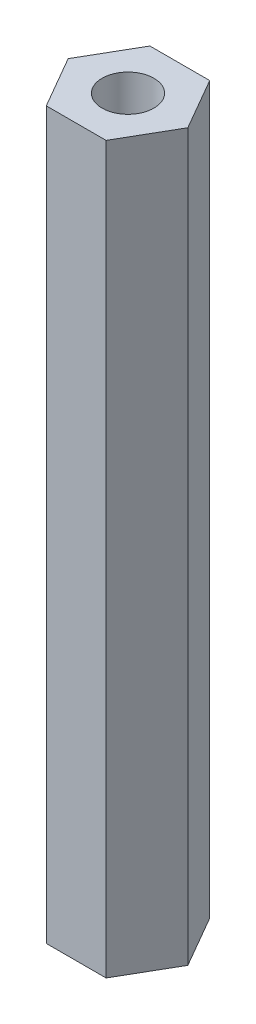
ISO-10303-21;
HEADER;
FILE_DESCRIPTION(('STEP AP214'),'2;1');
FILE_NAME('part.step','',(''),(''),'','','');
FILE_SCHEMA(('AUTOMOTIVE_DESIGN { 1 0 10303 214 1 1 1 1 }'));
ENDSEC;
DATA;
#1=APPLICATION_CONTEXT('core data for automotive mechanical design processes');
#2=APPLICATION_PROTOCOL_DEFINITION('international standard','automotive_design',2000,#1);
#3=PRODUCT_CONTEXT('',#1,'mechanical');
#4=PRODUCT('Part','Part','',(#3));
#5=PRODUCT_RELATED_PRODUCT_CATEGORY('part','',(#4));
#6=PRODUCT_DEFINITION_FORMATION('','',#4);
#7=PRODUCT_DEFINITION_CONTEXT('part definition',#1,'design');
#8=PRODUCT_DEFINITION('design','',#6,#7);
#9=PRODUCT_DEFINITION_SHAPE('','',#8);
#10=(LENGTH_UNIT() NAMED_UNIT(*) SI_UNIT(.MILLI.,.METRE.));
#11=(NAMED_UNIT(*) PLANE_ANGLE_UNIT() SI_UNIT($,.RADIAN.));
#12=(NAMED_UNIT(*) SI_UNIT($,.STERADIAN.) SOLID_ANGLE_UNIT());
#13=UNCERTAINTY_MEASURE_WITH_UNIT(LENGTH_MEASURE(1.E-05),#10,'distance_accuracy_value','');
#14=(GEOMETRIC_REPRESENTATION_CONTEXT(3) GLOBAL_UNCERTAINTY_ASSIGNED_CONTEXT((#13)) GLOBAL_UNIT_ASSIGNED_CONTEXT((#10,
#11,#12)) REPRESENTATION_CONTEXT('',''));
#15=CARTESIAN_POINT('',(0.,0.,0.));
#16=DIRECTION('',(0.,0.,1.));
#17=DIRECTION('',(1.,0.,0.));
#18=AXIS2_PLACEMENT_3D('',#15,#16,#17);
#19=CARTESIAN_POINT('',(0.,42.,0.));
#20=DIRECTION('',(0.,1.,0.));
#21=DIRECTION('',(0.,0.,1.));
#22=AXIS2_PLACEMENT_3D('',#19,#20,#21);
#23=PLANE('',#22);
#24=DIRECTION('',(-0.5,0.,-0.866025403784439));
#25=VECTOR('',#24,1.);
#26=CARTESIAN_POINT('',(3.46410161513775,42.,0.));
#27=LINE('',#26,#25);
#28=CARTESIAN_POINT('',(3.46410161513775,42.,0.));
#29=VERTEX_POINT('',#28);
#30=CARTESIAN_POINT('',(1.73205080756888,42.,-3.));
#31=VERTEX_POINT('',#30);
#32=EDGE_CURVE('E130',#29,#31,#27,.T.);
#33=ORIENTED_EDGE('',*,*,#32,.T.);
#34=DIRECTION('',(-1.,0.,0.));
#35=VECTOR('',#34,1.);
#36=CARTESIAN_POINT('',(1.73205080756888,42.,-3.));
#37=LINE('',#36,#35);
#38=CARTESIAN_POINT('',(-1.73205080756888,42.,-3.));
#39=VERTEX_POINT('',#38);
#40=EDGE_CURVE('E88',#31,#39,#37,.T.);
#41=ORIENTED_EDGE('',*,*,#40,.T.);
#42=DIRECTION('',(-0.5,0.,0.866025403784438));
#43=VECTOR('',#42,1.);
#44=CARTESIAN_POINT('',(-1.73205080756888,42.,-3.));
#45=LINE('',#44,#43);
#46=CARTESIAN_POINT('',(-3.46410161513775,42.,0.));
#47=VERTEX_POINT('',#46);
#48=EDGE_CURVE('E101',#39,#47,#45,.T.);
#49=ORIENTED_EDGE('',*,*,#48,.T.);
#50=DIRECTION('',(0.499999999999999,0.,0.866025403784439));
#51=VECTOR('',#50,1.);
#52=CARTESIAN_POINT('',(-3.46410161513775,42.,0.));
#53=LINE('',#52,#51);
#54=CARTESIAN_POINT('',(-1.73205080756888,42.,3.));
#55=VERTEX_POINT('',#54);
#56=EDGE_CURVE('E95',#47,#55,#53,.T.);
#57=ORIENTED_EDGE('',*,*,#56,.T.);
#58=DIRECTION('',(1.,0.,0.));
#59=VECTOR('',#58,1.);
#60=CARTESIAN_POINT('',(-1.73205080756888,42.,3.));
#61=LINE('',#60,#59);
#62=CARTESIAN_POINT('',(1.73205080756888,42.,3.));
#63=VERTEX_POINT('',#62);
#64=EDGE_CURVE('E99',#55,#63,#61,.T.);
#65=ORIENTED_EDGE('',*,*,#64,.T.);
#66=DIRECTION('',(0.5,0.,-0.866025403784438));
#67=VECTOR('',#66,1.);
#68=CARTESIAN_POINT('',(1.73205080756888,42.,3.));
#69=LINE('',#68,#67);
#70=EDGE_CURVE('E51',#63,#29,#69,.T.);
#71=ORIENTED_EDGE('',*,*,#70,.T.);
#72=EDGE_LOOP('',(#33,#41,#49,#57,#65,#71));
#73=FACE_BOUND('',#72,.T.);
#74=CARTESIAN_POINT('',(0.,42.,0.));
#75=DIRECTION('',(0.,1.,0.));
#76=DIRECTION('',(0.,0.,1.));
#77=AXIS2_PLACEMENT_3D('',#74,#75,#76);
#78=CIRCLE('',#77,1.5);
#79=CARTESIAN_POINT('',(0.,42.,1.5));
#80=VERTEX_POINT('',#79);
#81=EDGE_CURVE('E123',#80,#80,#78,.T.);
#82=ORIENTED_EDGE('',*,*,#81,.F.);
#83=EDGE_LOOP('',(#82));
#84=FACE_BOUND('',#83,.T.);
#85=ADVANCED_FACE('F34',(#73,#84),#23,.T.);
#86=CARTESIAN_POINT('',(0.,0.,0.));
#87=DIRECTION('',(0.,1.,0.));
#88=DIRECTION('',(0.,0.,1.));
#89=AXIS2_PLACEMENT_3D('',#86,#87,#88);
#90=PLANE('',#89);
#91=DIRECTION('',(-0.5,0.,-0.866025403784439));
#92=VECTOR('',#91,1.);
#93=CARTESIAN_POINT('',(3.46410161513775,0.,0.));
#94=LINE('',#93,#92);
#95=CARTESIAN_POINT('',(3.46410161513775,0.,0.));
#96=VERTEX_POINT('',#95);
#97=CARTESIAN_POINT('',(1.73205080756888,0.,-3.));
#98=VERTEX_POINT('',#97);
#99=EDGE_CURVE('E119',#96,#98,#94,.T.);
#100=ORIENTED_EDGE('',*,*,#99,.F.);
#101=DIRECTION('',(0.5,0.,-0.866025403784438));
#102=VECTOR('',#101,1.);
#103=CARTESIAN_POINT('',(1.73205080756888,0.,3.));
#104=LINE('',#103,#102);
#105=CARTESIAN_POINT('',(1.73205080756888,0.,3.));
#106=VERTEX_POINT('',#105);
#107=EDGE_CURVE('E80',#106,#96,#104,.T.);
#108=ORIENTED_EDGE('',*,*,#107,.F.);
#109=DIRECTION('',(1.,0.,0.));
#110=VECTOR('',#109,1.);
#111=CARTESIAN_POINT('',(-1.73205080756888,0.,3.));
#112=LINE('',#111,#110);
#113=CARTESIAN_POINT('',(-1.73205080756888,0.,3.));
#114=VERTEX_POINT('',#113);
#115=EDGE_CURVE('E74',#114,#106,#112,.T.);
#116=ORIENTED_EDGE('',*,*,#115,.F.);
#117=DIRECTION('',(0.499999999999999,0.,0.866025403784439));
#118=VECTOR('',#117,1.);
#119=CARTESIAN_POINT('',(-3.46410161513775,0.,0.));
#120=LINE('',#119,#118);
#121=CARTESIAN_POINT('',(-3.46410161513775,0.,0.));
#122=VERTEX_POINT('',#121);
#123=EDGE_CURVE('E109',#122,#114,#120,.T.);
#124=ORIENTED_EDGE('',*,*,#123,.F.);
#125=DIRECTION('',(-0.5,0.,0.866025403784438));
#126=VECTOR('',#125,1.);
#127=CARTESIAN_POINT('',(-1.73205080756888,0.,-3.));
#128=LINE('',#127,#126);
#129=CARTESIAN_POINT('',(-1.73205080756888,0.,-3.));
#130=VERTEX_POINT('',#129);
#131=EDGE_CURVE('E125',#130,#122,#128,.T.);
#132=ORIENTED_EDGE('',*,*,#131,.F.);
#133=DIRECTION('',(-1.,0.,0.));
#134=VECTOR('',#133,1.);
#135=CARTESIAN_POINT('',(1.73205080756888,0.,-3.));
#136=LINE('',#135,#134);
#137=EDGE_CURVE('E122',#98,#130,#136,.T.);
#138=ORIENTED_EDGE('',*,*,#137,.F.);
#139=EDGE_LOOP('',(#100,#108,#116,#124,#132,#138));
#140=FACE_BOUND('',#139,.T.);
#141=CARTESIAN_POINT('',(0.,0.,0.));
#142=DIRECTION('',(0.,1.,0.));
#143=DIRECTION('',(0.,0.,1.));
#144=AXIS2_PLACEMENT_3D('',#141,#142,#143);
#145=CIRCLE('',#144,1.5);
#146=CARTESIAN_POINT('',(0.,0.,1.5));
#147=VERTEX_POINT('',#146);
#148=EDGE_CURVE('E223',#147,#147,#145,.T.);
#149=ORIENTED_EDGE('',*,*,#148,.T.);
#150=EDGE_LOOP('',(#149));
#151=FACE_BOUND('',#150,.T.);
#152=ADVANCED_FACE('F139',(#140,#151),#90,.F.);
#153=CARTESIAN_POINT('',(3.46410161513775,42.,0.));
#154=DIRECTION('',(-0.866025403784439,0.,0.5));
#155=DIRECTION('',(0.5,0.,0.866025403784439));
#156=AXIS2_PLACEMENT_3D('',#153,#154,#155);
#157=PLANE('',#156);
#158=ORIENTED_EDGE('',*,*,#99,.T.);
#159=DIRECTION('',(0.,-1.,0.));
#160=VECTOR('',#159,1.);
#161=CARTESIAN_POINT('',(1.73205080756888,42.,-3.));
#162=LINE('',#161,#160);
#163=EDGE_CURVE('E11',#31,#98,#162,.T.);
#164=ORIENTED_EDGE('',*,*,#163,.F.);
#165=ORIENTED_EDGE('',*,*,#32,.F.);
#166=DIRECTION('',(0.,-1.,0.));
#167=VECTOR('',#166,1.);
#168=CARTESIAN_POINT('',(3.46410161513775,42.,0.));
#169=LINE('',#168,#167);
#170=EDGE_CURVE('E115',#29,#96,#169,.T.);
#171=ORIENTED_EDGE('',*,*,#170,.T.);
#172=EDGE_LOOP('',(#158,#164,#165,#171));
#173=FACE_BOUND('',#172,.T.);
#174=ADVANCED_FACE('F36',(#173),#157,.F.);
#175=CARTESIAN_POINT('',(1.73205080756888,42.,-3.));
#176=DIRECTION('',(0.,0.,1.));
#177=DIRECTION('',(1.,0.,0.));
#178=AXIS2_PLACEMENT_3D('',#175,#176,#177);
#179=PLANE('',#178);
#180=ORIENTED_EDGE('',*,*,#137,.T.);
#181=DIRECTION('',(0.,-1.,0.));
#182=VECTOR('',#181,1.);
#183=CARTESIAN_POINT('',(-1.73205080756888,42.,-3.));
#184=LINE('',#183,#182);
#185=EDGE_CURVE('E43',#39,#130,#184,.T.);
#186=ORIENTED_EDGE('',*,*,#185,.F.);
#187=ORIENTED_EDGE('',*,*,#40,.F.);
#188=ORIENTED_EDGE('',*,*,#163,.T.);
#189=EDGE_LOOP('',(#180,#186,#187,#188));
#190=FACE_BOUND('',#189,.T.);
#191=ADVANCED_FACE('F164',(#190),#179,.F.);
#192=CARTESIAN_POINT('',(-1.73205080756888,42.,-3.));
#193=DIRECTION('',(0.866025403784438,0.,0.5));
#194=DIRECTION('',(0.5,0.,-0.866025403784438));
#195=AXIS2_PLACEMENT_3D('',#192,#193,#194);
#196=PLANE('',#195);
#197=ORIENTED_EDGE('',*,*,#131,.T.);
#198=DIRECTION('',(0.,-1.,0.));
#199=VECTOR('',#198,1.);
#200=CARTESIAN_POINT('',(-3.46410161513775,42.,0.));
#201=LINE('',#200,#199);
#202=EDGE_CURVE('E110',#47,#122,#201,.T.);
#203=ORIENTED_EDGE('',*,*,#202,.F.);
#204=ORIENTED_EDGE('',*,*,#48,.F.);
#205=ORIENTED_EDGE('',*,*,#185,.T.);
#206=EDGE_LOOP('',(#197,#203,#204,#205));
#207=FACE_BOUND('',#206,.T.);
#208=ADVANCED_FACE('F136',(#207),#196,.F.);
#209=CARTESIAN_POINT('',(-3.46410161513775,42.,0.));
#210=DIRECTION('',(0.866025403784439,0.,-0.499999999999999));
#211=DIRECTION('',(-0.5,0.,-0.866025403784439));
#212=AXIS2_PLACEMENT_3D('',#209,#210,#211);
#213=PLANE('',#212);
#214=ORIENTED_EDGE('',*,*,#123,.T.);
#215=DIRECTION('',(0.,-1.,0.));
#216=VECTOR('',#215,1.);
#217=CARTESIAN_POINT('',(-1.73205080756888,42.,3.));
#218=LINE('',#217,#216);
#219=EDGE_CURVE('E106',#55,#114,#218,.T.);
#220=ORIENTED_EDGE('',*,*,#219,.F.);
#221=ORIENTED_EDGE('',*,*,#56,.F.);
#222=ORIENTED_EDGE('',*,*,#202,.T.);
#223=EDGE_LOOP('',(#214,#220,#221,#222));
#224=FACE_BOUND('',#223,.T.);
#225=ADVANCED_FACE('F107',(#224),#213,.F.);
#226=CARTESIAN_POINT('',(-1.73205080756888,42.,3.));
#227=DIRECTION('',(0.,0.,-1.));
#228=DIRECTION('',(-1.,0.,0.));
#229=AXIS2_PLACEMENT_3D('',#226,#227,#228);
#230=PLANE('',#229);
#231=ORIENTED_EDGE('',*,*,#115,.T.);
#232=DIRECTION('',(0.,-1.,0.));
#233=VECTOR('',#232,1.);
#234=CARTESIAN_POINT('',(1.73205080756888,42.,3.));
#235=LINE('',#234,#233);
#236=EDGE_CURVE('E111',#63,#106,#235,.T.);
#237=ORIENTED_EDGE('',*,*,#236,.F.);
#238=ORIENTED_EDGE('',*,*,#64,.F.);
#239=ORIENTED_EDGE('',*,*,#219,.T.);
#240=EDGE_LOOP('',(#231,#237,#238,#239));
#241=FACE_BOUND('',#240,.T.);
#242=ADVANCED_FACE('F113',(#241),#230,.F.);
#243=CARTESIAN_POINT('',(1.73205080756888,42.,3.));
#244=DIRECTION('',(-0.866025403784438,0.,-0.5));
#245=DIRECTION('',(-0.5,0.,0.866025403784438));
#246=AXIS2_PLACEMENT_3D('',#243,#244,#245);
#247=PLANE('',#246);
#248=ORIENTED_EDGE('',*,*,#107,.T.);
#249=ORIENTED_EDGE('',*,*,#170,.F.);
#250=ORIENTED_EDGE('',*,*,#70,.F.);
#251=ORIENTED_EDGE('',*,*,#236,.T.);
#252=EDGE_LOOP('',(#248,#249,#250,#251));
#253=FACE_BOUND('',#252,.T.);
#254=ADVANCED_FACE('F144',(#253),#247,.F.);
#255=CARTESIAN_POINT('',(0.,42.,0.));
#256=DIRECTION('',(0.,-1.,0.));
#257=DIRECTION('',(0.,0.,-1.));
#258=AXIS2_PLACEMENT_3D('',#255,#256,#257);
#259=CYLINDRICAL_SURFACE('',#258,1.5);
#260=ORIENTED_EDGE('',*,*,#81,.T.);
#261=EDGE_LOOP('',(#260));
#262=FACE_BOUND('',#261,.T.);
#263=ORIENTED_EDGE('',*,*,#148,.F.);
#264=EDGE_LOOP('',(#263));
#265=FACE_BOUND('',#264,.T.);
#266=ADVANCED_FACE('F146',(#262,#265),#259,.F.);
#267=CLOSED_SHELL('',(#85,#152,#174,#191,#208,#225,#242,#254,#266));
#268=MANIFOLD_SOLID_BREP('B2',#267);
#269=ADVANCED_BREP_SHAPE_REPRESENTATION('',(#18,#268),#14);
#270=SHAPE_DEFINITION_REPRESENTATION(#9,#269);
ENDSEC;
END-ISO-10303-21;
